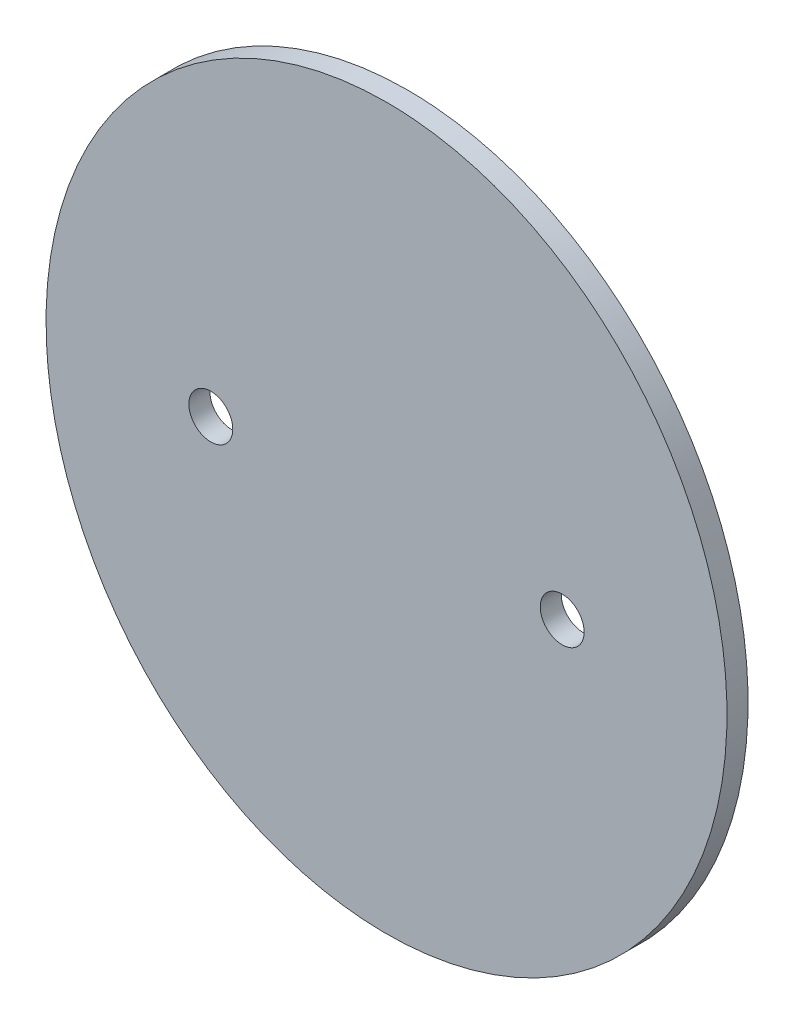
ISO-10303-21;
HEADER;
FILE_DESCRIPTION(('STEP AP214'),'2;1');
FILE_NAME('part.step','',(''),(''),'','','');
FILE_SCHEMA(('AUTOMOTIVE_DESIGN { 1 0 10303 214 1 1 1 1 }'));
ENDSEC;
DATA;
#1=APPLICATION_CONTEXT('core data for automotive mechanical design processes');
#2=APPLICATION_PROTOCOL_DEFINITION('international standard','automotive_design',2000,#1);
#3=PRODUCT_CONTEXT('',#1,'mechanical');
#4=PRODUCT('Part','Part','',(#3));
#5=PRODUCT_RELATED_PRODUCT_CATEGORY('part','',(#4));
#6=PRODUCT_DEFINITION_FORMATION('','',#4);
#7=PRODUCT_DEFINITION_CONTEXT('part definition',#1,'design');
#8=PRODUCT_DEFINITION('design','',#6,#7);
#9=PRODUCT_DEFINITION_SHAPE('','',#8);
#10=(LENGTH_UNIT() NAMED_UNIT(*) SI_UNIT(.MILLI.,.METRE.));
#11=(NAMED_UNIT(*) PLANE_ANGLE_UNIT() SI_UNIT($,.RADIAN.));
#12=(NAMED_UNIT(*) SI_UNIT($,.STERADIAN.) SOLID_ANGLE_UNIT());
#13=UNCERTAINTY_MEASURE_WITH_UNIT(LENGTH_MEASURE(1.E-05),#10,'distance_accuracy_value','');
#14=(GEOMETRIC_REPRESENTATION_CONTEXT(3) GLOBAL_UNCERTAINTY_ASSIGNED_CONTEXT((#13)) GLOBAL_UNIT_ASSIGNED_CONTEXT((#10,
#11,#12)) REPRESENTATION_CONTEXT('',''));
#15=CARTESIAN_POINT('',(0.,0.,0.));
#16=DIRECTION('',(0.,0.,1.));
#17=DIRECTION('',(1.,0.,0.));
#18=AXIS2_PLACEMENT_3D('',#15,#16,#17);
#19=CARTESIAN_POINT('',(0.,0.,6.));
#20=DIRECTION('',(0.,0.,1.));
#21=DIRECTION('',(1.,0.,0.));
#22=AXIS2_PLACEMENT_3D('',#19,#20,#21);
#23=PLANE('',#22);
#24=CARTESIAN_POINT('',(-50.,0.,6.));
#25=DIRECTION('',(0.,0.,1.));
#26=DIRECTION('',(1.,0.,0.));
#27=AXIS2_PLACEMENT_3D('',#24,#25,#26);
#28=CIRCLE('',#27,6.25000000000001);
#29=CARTESIAN_POINT('',(-43.75,0.,6.));
#30=VERTEX_POINT('',#29);
#31=EDGE_CURVE('E45',#30,#30,#28,.T.);
#32=ORIENTED_EDGE('',*,*,#31,.F.);
#33=EDGE_LOOP('',(#32));
#34=FACE_BOUND('',#33,.T.);
#35=CARTESIAN_POINT('',(0.,0.,6.));
#36=DIRECTION('',(0.,0.,1.));
#37=DIRECTION('',(0.,1.,0.));
#38=AXIS2_PLACEMENT_3D('',#35,#36,#37);
#39=ELLIPSE('',#38,102.5,96.9);
#40=CARTESIAN_POINT('',(0.,102.5,6.));
#41=VERTEX_POINT('',#40);
#42=EDGE_CURVE('E10',#41,#41,#39,.T.);
#43=ORIENTED_EDGE('',*,*,#42,.T.);
#44=EDGE_LOOP('',(#43));
#45=FACE_BOUND('',#44,.T.);
#46=CARTESIAN_POINT('',(50.,0.,6.));
#47=DIRECTION('',(0.,0.,1.));
#48=DIRECTION('',(1.,0.,0.));
#49=AXIS2_PLACEMENT_3D('',#46,#47,#48);
#50=CIRCLE('',#49,6.25);
#51=CARTESIAN_POINT('',(56.25,0.,6.));
#52=VERTEX_POINT('',#51);
#53=EDGE_CURVE('E51',#52,#52,#50,.T.);
#54=ORIENTED_EDGE('',*,*,#53,.F.);
#55=EDGE_LOOP('',(#54));
#56=FACE_BOUND('',#55,.T.);
#57=ADVANCED_FACE('F34',(#34,#45,#56),#23,.T.);
#58=CARTESIAN_POINT('',(0.,0.,0.));
#59=DIRECTION('',(0.,0.,1.));
#60=DIRECTION('',(1.,0.,0.));
#61=AXIS2_PLACEMENT_3D('',#58,#59,#60);
#62=PLANE('',#61);
#63=CARTESIAN_POINT('',(0.,0.,0.));
#64=DIRECTION('',(0.,0.,1.));
#65=DIRECTION('',(0.,1.,0.));
#66=AXIS2_PLACEMENT_3D('',#63,#64,#65);
#67=ELLIPSE('',#66,102.5,96.9);
#68=CARTESIAN_POINT('',(0.,102.5,0.));
#69=VERTEX_POINT('',#68);
#70=EDGE_CURVE('E39',#69,#69,#67,.T.);
#71=ORIENTED_EDGE('',*,*,#70,.F.);
#72=EDGE_LOOP('',(#71));
#73=FACE_BOUND('',#72,.T.);
#74=CARTESIAN_POINT('',(-50.,0.,0.));
#75=DIRECTION('',(0.,0.,1.));
#76=DIRECTION('',(1.,0.,0.));
#77=AXIS2_PLACEMENT_3D('',#74,#75,#76);
#78=CIRCLE('',#77,6.25000000000001);
#79=CARTESIAN_POINT('',(-43.75,0.,0.));
#80=VERTEX_POINT('',#79);
#81=EDGE_CURVE('E48',#80,#80,#78,.T.);
#82=ORIENTED_EDGE('',*,*,#81,.T.);
#83=EDGE_LOOP('',(#82));
#84=FACE_BOUND('',#83,.T.);
#85=CARTESIAN_POINT('',(50.,0.,0.));
#86=DIRECTION('',(0.,0.,1.));
#87=DIRECTION('',(1.,0.,0.));
#88=AXIS2_PLACEMENT_3D('',#85,#86,#87);
#89=CIRCLE('',#88,6.25);
#90=CARTESIAN_POINT('',(56.25,0.,0.));
#91=VERTEX_POINT('',#90);
#92=EDGE_CURVE('E54',#91,#91,#89,.T.);
#93=ORIENTED_EDGE('',*,*,#92,.T.);
#94=EDGE_LOOP('',(#93));
#95=FACE_BOUND('',#94,.T.);
#96=ADVANCED_FACE('F64',(#73,#84,#95),#62,.F.);
#97=DIRECTION('',(0.,0.,-1.));
#98=VECTOR('',#97,1.);
#99=SURFACE_OF_LINEAR_EXTRUSION('',#39,#98);
#100=ORIENTED_EDGE('',*,*,#42,.F.);
#101=EDGE_LOOP('',(#100));
#102=FACE_BOUND('',#101,.T.);
#103=ORIENTED_EDGE('',*,*,#70,.T.);
#104=EDGE_LOOP('',(#103));
#105=FACE_BOUND('',#104,.T.);
#106=ADVANCED_FACE('F36',(#102,#105),#99,.F.);
#107=CARTESIAN_POINT('',(-50.,0.,6.));
#108=DIRECTION('',(0.,0.,-1.));
#109=DIRECTION('',(-1.,0.,0.));
#110=AXIS2_PLACEMENT_3D('',#107,#108,#109);
#111=CYLINDRICAL_SURFACE('',#110,6.25000000000001);
#112=ORIENTED_EDGE('',*,*,#31,.T.);
#113=EDGE_LOOP('',(#112));
#114=FACE_BOUND('',#113,.T.);
#115=ORIENTED_EDGE('',*,*,#81,.F.);
#116=EDGE_LOOP('',(#115));
#117=FACE_BOUND('',#116,.T.);
#118=ADVANCED_FACE('F73',(#114,#117),#111,.F.);
#119=CARTESIAN_POINT('',(50.,0.,6.));
#120=DIRECTION('',(0.,0.,-1.));
#121=DIRECTION('',(-1.,0.,0.));
#122=AXIS2_PLACEMENT_3D('',#119,#120,#121);
#123=CYLINDRICAL_SURFACE('',#122,6.25);
#124=ORIENTED_EDGE('',*,*,#53,.T.);
#125=EDGE_LOOP('',(#124));
#126=FACE_BOUND('',#125,.T.);
#127=ORIENTED_EDGE('',*,*,#92,.F.);
#128=EDGE_LOOP('',(#127));
#129=FACE_BOUND('',#128,.T.);
#130=ADVANCED_FACE('F60',(#126,#129),#123,.F.);
#131=CLOSED_SHELL('',(#57,#96,#106,#118,#130));
#132=MANIFOLD_SOLID_BREP('B2',#131);
#133=ADVANCED_BREP_SHAPE_REPRESENTATION('',(#18,#132),#14);
#134=SHAPE_DEFINITION_REPRESENTATION(#9,#133);
ENDSEC;
END-ISO-10303-21;
